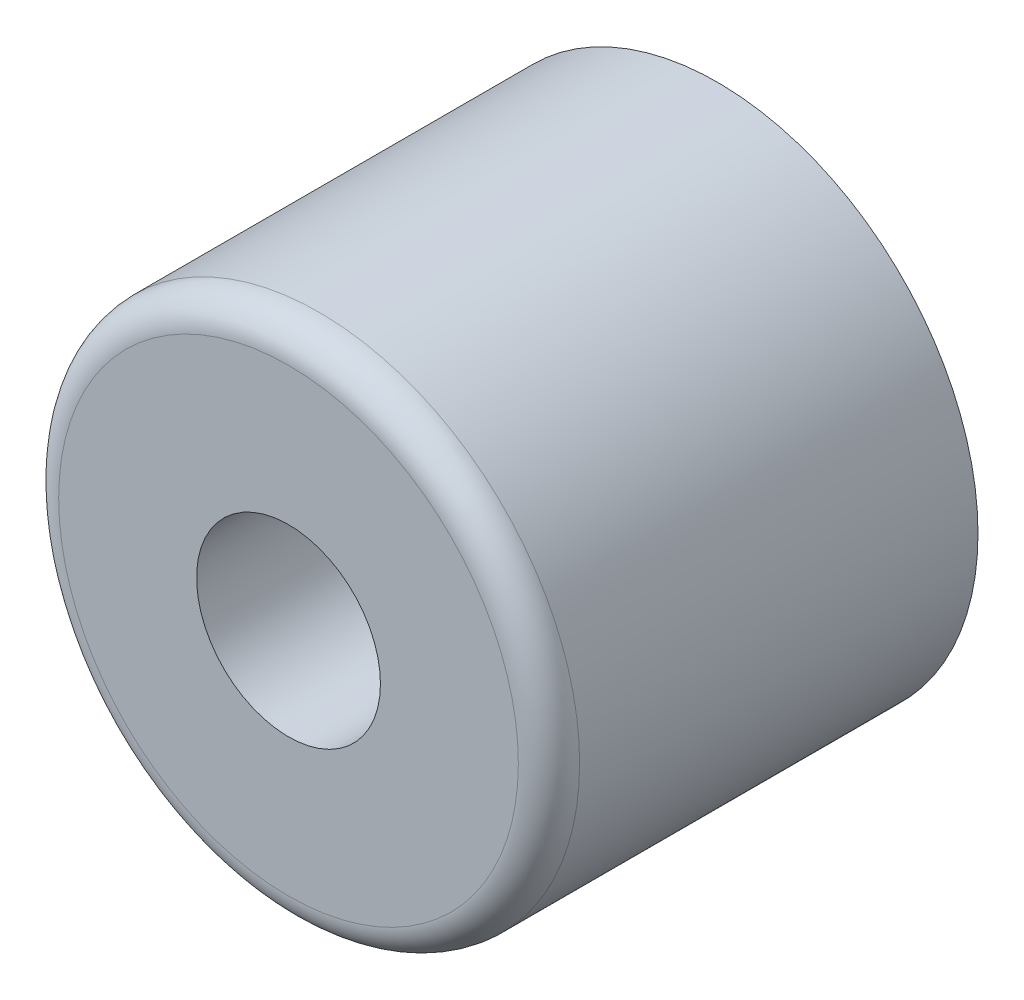
ISO-10303-21;
HEADER;
FILE_DESCRIPTION(('STEP AP214'),'2;1');
FILE_NAME('part.step','',(''),(''),'','','');
FILE_SCHEMA(('AUTOMOTIVE_DESIGN { 1 0 10303 214 1 1 1 1 }'));
ENDSEC;
DATA;
#1=APPLICATION_CONTEXT('core data for automotive mechanical design processes');
#2=APPLICATION_PROTOCOL_DEFINITION('international standard','automotive_design',2000,#1);
#3=PRODUCT_CONTEXT('',#1,'mechanical');
#4=PRODUCT('Part','Part','',(#3));
#5=PRODUCT_RELATED_PRODUCT_CATEGORY('part','',(#4));
#6=PRODUCT_DEFINITION_FORMATION('','',#4);
#7=PRODUCT_DEFINITION_CONTEXT('part definition',#1,'design');
#8=PRODUCT_DEFINITION('design','',#6,#7);
#9=PRODUCT_DEFINITION_SHAPE('','',#8);
#10=(LENGTH_UNIT() NAMED_UNIT(*) SI_UNIT(.MILLI.,.METRE.));
#11=(NAMED_UNIT(*) PLANE_ANGLE_UNIT() SI_UNIT($,.RADIAN.));
#12=(NAMED_UNIT(*) SI_UNIT($,.STERADIAN.) SOLID_ANGLE_UNIT());
#13=UNCERTAINTY_MEASURE_WITH_UNIT(LENGTH_MEASURE(1.E-05),#10,'distance_accuracy_value','');
#14=(GEOMETRIC_REPRESENTATION_CONTEXT(3) GLOBAL_UNCERTAINTY_ASSIGNED_CONTEXT((#13)) GLOBAL_UNIT_ASSIGNED_CONTEXT((#10,
#11,#12)) REPRESENTATION_CONTEXT('',''));
#15=CARTESIAN_POINT('',(0.,0.,0.));
#16=DIRECTION('',(0.,0.,1.));
#17=DIRECTION('',(1.,0.,0.));
#18=AXIS2_PLACEMENT_3D('',#15,#16,#17);
#19=CARTESIAN_POINT('',(0.,0.,70.));
#20=DIRECTION('',(0.,0.,1.));
#21=DIRECTION('',(1.,0.,0.));
#22=AXIS2_PLACEMENT_3D('',#19,#20,#21);
#23=PLANE('',#22);
#24=CARTESIAN_POINT('',(0.,0.,70.));
#25=DIRECTION('',(0.,0.,1.));
#26=DIRECTION('',(1.,0.,0.));
#27=AXIS2_PLACEMENT_3D('',#24,#25,#26);
#28=CIRCLE('',#27,37.5);
#29=CARTESIAN_POINT('',(37.5,0.,70.));
#30=VERTEX_POINT('',#29);
#31=EDGE_CURVE('E51',#30,#30,#28,.T.);
#32=ORIENTED_EDGE('',*,*,#31,.T.);
#33=EDGE_LOOP('',(#32));
#34=FACE_BOUND('',#33,.T.);
#35=CARTESIAN_POINT('',(0.,0.,70.));
#36=DIRECTION('',(0.,0.,1.));
#37=DIRECTION('',(1.,0.,0.));
#38=AXIS2_PLACEMENT_3D('',#35,#36,#37);
#39=CIRCLE('',#38,15.);
#40=CARTESIAN_POINT('',(15.,0.,70.));
#41=VERTEX_POINT('',#40);
#42=EDGE_CURVE('E61',#41,#41,#39,.T.);
#43=ORIENTED_EDGE('',*,*,#42,.F.);
#44=EDGE_LOOP('',(#43));
#45=FACE_BOUND('',#44,.T.);
#46=ADVANCED_FACE('F43',(#34,#45),#23,.T.);
#47=CARTESIAN_POINT('',(0.,0.,0.));
#48=DIRECTION('',(0.,0.,1.));
#49=DIRECTION('',(1.,0.,0.));
#50=AXIS2_PLACEMENT_3D('',#47,#48,#49);
#51=PLANE('',#50);
#52=CARTESIAN_POINT('',(0.,0.,0.));
#53=DIRECTION('',(0.,0.,1.));
#54=DIRECTION('',(1.,0.,0.));
#55=AXIS2_PLACEMENT_3D('',#52,#53,#54);
#56=CIRCLE('',#55,42.5);
#57=CARTESIAN_POINT('',(42.5,0.,0.));
#58=VERTEX_POINT('',#57);
#59=EDGE_CURVE('E56',#58,#58,#56,.T.);
#60=ORIENTED_EDGE('',*,*,#59,.F.);
#61=EDGE_LOOP('',(#60));
#62=FACE_BOUND('',#61,.T.);
#63=CARTESIAN_POINT('',(0.,0.,0.));
#64=DIRECTION('',(0.,0.,1.));
#65=DIRECTION('',(1.,0.,0.));
#66=AXIS2_PLACEMENT_3D('',#63,#64,#65);
#67=CIRCLE('',#66,15.);
#68=CARTESIAN_POINT('',(15.,0.,0.));
#69=VERTEX_POINT('',#68);
#70=EDGE_CURVE('E64',#69,#69,#67,.T.);
#71=ORIENTED_EDGE('',*,*,#70,.T.);
#72=EDGE_LOOP('',(#71));
#73=FACE_BOUND('',#72,.T.);
#74=ADVANCED_FACE('F76',(#62,#73),#51,.F.);
#75=CARTESIAN_POINT('',(0.,0.,70.));
#76=DIRECTION('',(0.,0.,-1.));
#77=DIRECTION('',(-1.,0.,0.));
#78=AXIS2_PLACEMENT_3D('',#75,#76,#77);
#79=CYLINDRICAL_SURFACE('',#78,42.5);
#80=CARTESIAN_POINT('',(0.,0.,65.));
#81=DIRECTION('',(0.,0.,1.));
#82=DIRECTION('',(1.,0.,0.));
#83=AXIS2_PLACEMENT_3D('',#80,#81,#82);
#84=CIRCLE('',#83,42.5);
#85=CARTESIAN_POINT('',(42.5,0.,65.));
#86=VERTEX_POINT('',#85);
#87=EDGE_CURVE('E10',#86,#86,#84,.F.);
#88=ORIENTED_EDGE('',*,*,#87,.T.);
#89=EDGE_LOOP('',(#88));
#90=FACE_BOUND('',#89,.T.);
#91=ORIENTED_EDGE('',*,*,#59,.T.);
#92=EDGE_LOOP('',(#91));
#93=FACE_BOUND('',#92,.T.);
#94=ADVANCED_FACE('F83',(#90,#93),#79,.T.);
#95=CARTESIAN_POINT('',(0.,0.,70.));
#96=DIRECTION('',(0.,0.,-1.));
#97=DIRECTION('',(-1.,0.,0.));
#98=AXIS2_PLACEMENT_3D('',#95,#96,#97);
#99=CYLINDRICAL_SURFACE('',#98,15.);
#100=ORIENTED_EDGE('',*,*,#42,.T.);
#101=EDGE_LOOP('',(#100));
#102=FACE_BOUND('',#101,.T.);
#103=ORIENTED_EDGE('',*,*,#70,.F.);
#104=EDGE_LOOP('',(#103));
#105=FACE_BOUND('',#104,.T.);
#106=ADVANCED_FACE('F72',(#102,#105),#99,.F.);
#107=CARTESIAN_POINT('',(0.,0.,65.));
#108=DIRECTION('',(0.,0.,1.));
#109=DIRECTION('',(1.,0.,0.));
#110=AXIS2_PLACEMENT_3D('',#107,#108,#109);
#111=TOROIDAL_SURFACE('',#110,37.5,5.);
#112=ORIENTED_EDGE('',*,*,#87,.F.);
#113=EDGE_LOOP('',(#112));
#114=FACE_BOUND('',#113,.T.);
#115=ORIENTED_EDGE('',*,*,#31,.F.);
#116=EDGE_LOOP('',(#115));
#117=FACE_BOUND('',#116,.T.);
#118=ADVANCED_FACE('F45',(#114,#117),#111,.T.);
#119=CLOSED_SHELL('',(#46,#74,#94,#106,#118));
#120=MANIFOLD_SOLID_BREP('B2',#119);
#121=ADVANCED_BREP_SHAPE_REPRESENTATION('',(#18,#120),#14);
#122=SHAPE_DEFINITION_REPRESENTATION(#9,#121);
ENDSEC;
END-ISO-10303-21;
